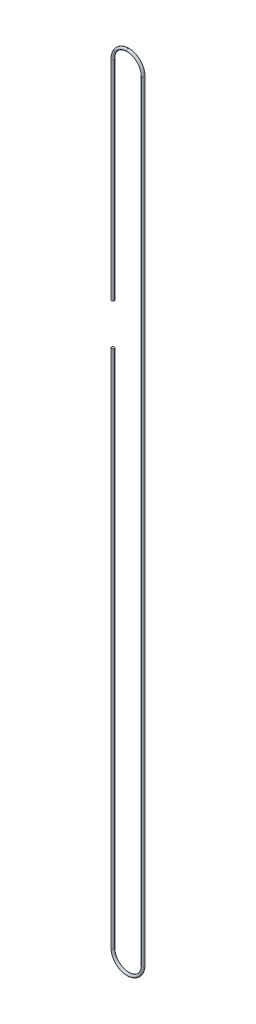
ISO-10303-21;
HEADER;
FILE_DESCRIPTION(('STEP AP214'),'2;1');
FILE_NAME('part.step','',(''),(''),'','','');
FILE_SCHEMA(('AUTOMOTIVE_DESIGN { 1 0 10303 214 1 1 1 1 }'));
ENDSEC;
DATA;
#1=APPLICATION_CONTEXT('core data for automotive mechanical design processes');
#2=APPLICATION_PROTOCOL_DEFINITION('international standard','automotive_design',2000,#1);
#3=PRODUCT_CONTEXT('',#1,'mechanical');
#4=PRODUCT('Part','Part','',(#3));
#5=PRODUCT_RELATED_PRODUCT_CATEGORY('part','',(#4));
#6=PRODUCT_DEFINITION_FORMATION('','',#4);
#7=PRODUCT_DEFINITION_CONTEXT('part definition',#1,'design');
#8=PRODUCT_DEFINITION('design','',#6,#7);
#9=PRODUCT_DEFINITION_SHAPE('','',#8);
#10=(LENGTH_UNIT() NAMED_UNIT(*) SI_UNIT(.MILLI.,.METRE.));
#11=(NAMED_UNIT(*) PLANE_ANGLE_UNIT() SI_UNIT($,.RADIAN.));
#12=(NAMED_UNIT(*) SI_UNIT($,.STERADIAN.) SOLID_ANGLE_UNIT());
#13=UNCERTAINTY_MEASURE_WITH_UNIT(LENGTH_MEASURE(1.E-05),#10,'distance_accuracy_value','');
#14=(GEOMETRIC_REPRESENTATION_CONTEXT(3) GLOBAL_UNCERTAINTY_ASSIGNED_CONTEXT((#13)) GLOBAL_UNIT_ASSIGNED_CONTEXT((#10,
#11,#12)) REPRESENTATION_CONTEXT('',''));
#15=CARTESIAN_POINT('',(0.,0.,0.));
#16=DIRECTION('',(0.,0.,1.));
#17=DIRECTION('',(1.,0.,0.));
#18=AXIS2_PLACEMENT_3D('',#15,#16,#17);
#19=CARTESIAN_POINT('',(-17.4625,0.,0.));
#20=DIRECTION('',(0.,1.,0.));
#21=DIRECTION('',(-1.,0.,0.));
#22=AXIS2_PLACEMENT_3D('',#19,#20,#21);
#23=CYLINDRICAL_SURFACE('',#22,1.58750000000002);
#24=CARTESIAN_POINT('',(-17.4625000000001,647.7,0.));
#25=DIRECTION('',(0.,1.,0.));
#26=DIRECTION('',(0.,0.,1.));
#27=AXIS2_PLACEMENT_3D('',#24,#25,#26);
#28=CIRCLE('',#27,1.58750000000002);
#29=CARTESIAN_POINT('',(-17.4625000000001,647.7,1.58750000000002));
#30=VERTEX_POINT('',#29);
#31=EDGE_CURVE('E10',#30,#30,#28,.F.);
#32=ORIENTED_EDGE('',*,*,#31,.F.);
#33=EDGE_LOOP('',(#32));
#34=FACE_BOUND('',#33,.T.);
#35=CARTESIAN_POINT('',(-17.4625000000002,889.,0.));
#36=DIRECTION('',(0.,1.,0.));
#37=DIRECTION('',(0.,0.,-1.));
#38=AXIS2_PLACEMENT_3D('',#35,#36,#37);
#39=CIRCLE('',#38,1.58750000000002);
#40=CARTESIAN_POINT('',(-19.0500000000002,889.,0.));
#41=VERTEX_POINT('',#40);
#42=EDGE_CURVE('E50',#41,#41,#39,.T.);
#43=ORIENTED_EDGE('',*,*,#42,.F.);
#44=EDGE_LOOP('',(#43));
#45=FACE_BOUND('',#44,.T.);
#46=ADVANCED_FACE('F36',(#34,#45),#23,.T.);
#47=CARTESIAN_POINT('',(0.,889.,0.));
#48=DIRECTION('',(0.,0.,-1.));
#49=DIRECTION('',(-1.,0.,0.));
#50=AXIS2_PLACEMENT_3D('',#47,#48,#49);
#51=TOROIDAL_SURFACE('',#50,17.4625000000002,1.58750000000002);
#52=CARTESIAN_POINT('',(0.,906.4625,0.));
#53=DIRECTION('',(1.,0.,0.));
#54=DIRECTION('',(0.,0.,-1.));
#55=AXIS2_PLACEMENT_3D('',#52,#53,#54);
#56=CIRCLE('',#55,1.58750000000002);
#57=CARTESIAN_POINT('',(0.,908.05,0.));
#58=VERTEX_POINT('',#57);
#59=EDGE_CURVE('E69',#58,#58,#56,.T.);
#60=CARTESIAN_POINT('',(0.,889.,0.));
#61=DIRECTION('',(0.,0.,-1.));
#62=DIRECTION('',(-1.,0.,0.));
#63=AXIS2_PLACEMENT_3D('',#60,#61,#62);
#64=CIRCLE('',#63,19.0500000000002);
#65=EDGE_CURVE('',#41,#58,#64,.T.);
#66=ORIENTED_EDGE('',*,*,#42,.T.);
#67=ORIENTED_EDGE('',*,*,#59,.F.);
#68=ORIENTED_EDGE('',*,*,#65,.T.);
#69=ORIENTED_EDGE('',*,*,#65,.F.);
#70=EDGE_LOOP('',(#66,#68,#67,#69));
#71=FACE_BOUND('',#70,.T.);
#72=ADVANCED_FACE('F38',(#71),#51,.T.);
#73=CARTESIAN_POINT('',(-17.4625000000001,600.075,0.));
#74=DIRECTION('',(0.,-1.,0.));
#75=DIRECTION('',(0.,0.,-1.));
#76=AXIS2_PLACEMENT_3D('',#73,#74,#75);
#77=CIRCLE('',#76,1.58750000000002);
#78=CARTESIAN_POINT('',(-17.4625000000001,600.075,-1.58750000000002));
#79=VERTEX_POINT('',#78);
#80=EDGE_CURVE('E44',#79,#79,#77,.F.);
#81=ORIENTED_EDGE('',*,*,#80,.F.);
#82=EDGE_LOOP('',(#81));
#83=FACE_BOUND('',#82,.T.);
#84=CARTESIAN_POINT('',(-17.4625,0.,0.));
#85=DIRECTION('',(0.,1.,0.));
#86=DIRECTION('',(0.,0.,-1.));
#87=AXIS2_PLACEMENT_3D('',#84,#85,#86);
#88=CIRCLE('',#87,1.58750000000002);
#89=CARTESIAN_POINT('',(-19.0500000000001,0.,0.));
#90=VERTEX_POINT('',#89);
#91=EDGE_CURVE('E57',#90,#90,#88,.T.);
#92=ORIENTED_EDGE('',*,*,#91,.T.);
#93=EDGE_LOOP('',(#92));
#94=FACE_BOUND('',#93,.T.);
#95=ADVANCED_FACE('F77',(#83,#94),#23,.T.);
#96=CARTESIAN_POINT('',(0.,0.,0.));
#97=DIRECTION('',(0.,0.,-1.));
#98=DIRECTION('',(-1.,0.,0.));
#99=AXIS2_PLACEMENT_3D('',#96,#97,#98);
#100=TOROIDAL_SURFACE('',#99,17.4625,1.58750000000002);
#101=CARTESIAN_POINT('',(17.4625,0.,0.));
#102=DIRECTION('',(0.,-1.,0.));
#103=DIRECTION('',(0.,0.,-1.));
#104=AXIS2_PLACEMENT_3D('',#101,#102,#103);
#105=CIRCLE('',#104,1.58750000000002);
#106=CARTESIAN_POINT('',(19.0500000000001,0.,0.));
#107=VERTEX_POINT('',#106);
#108=EDGE_CURVE('E62',#107,#107,#105,.T.);
#109=CARTESIAN_POINT('',(0.,0.,0.));
#110=DIRECTION('',(0.,0.,-1.));
#111=DIRECTION('',(-1.,0.,0.));
#112=AXIS2_PLACEMENT_3D('',#109,#110,#111);
#113=CIRCLE('',#112,19.0500000000001);
#114=EDGE_CURVE('',#107,#90,#113,.T.);
#115=ORIENTED_EDGE('',*,*,#108,.T.);
#116=ORIENTED_EDGE('',*,*,#91,.F.);
#117=ORIENTED_EDGE('',*,*,#114,.T.);
#118=ORIENTED_EDGE('',*,*,#114,.F.);
#119=EDGE_LOOP('',(#115,#117,#116,#118));
#120=FACE_BOUND('',#119,.T.);
#121=ADVANCED_FACE('F86',(#120),#100,.T.);
#122=CARTESIAN_POINT('',(17.4625000000002,889.,0.));
#123=DIRECTION('',(0.,-1.,0.));
#124=DIRECTION('',(1.,0.,0.));
#125=AXIS2_PLACEMENT_3D('',#122,#123,#124);
#126=CYLINDRICAL_SURFACE('',#125,1.58750000000002);
#127=ORIENTED_EDGE('',*,*,#108,.F.);
#128=EDGE_LOOP('',(#127));
#129=FACE_BOUND('',#128,.T.);
#130=CARTESIAN_POINT('',(17.4625000000002,889.,0.));
#131=DIRECTION('',(0.,-1.,0.));
#132=DIRECTION('',(0.,0.,-1.));
#133=AXIS2_PLACEMENT_3D('',#130,#131,#132);
#134=CIRCLE('',#133,1.58750000000002);
#135=CARTESIAN_POINT('',(19.0500000000002,889.,0.));
#136=VERTEX_POINT('',#135);
#137=EDGE_CURVE('E65',#136,#136,#134,.T.);
#138=ORIENTED_EDGE('',*,*,#137,.T.);
#139=EDGE_LOOP('',(#138));
#140=FACE_BOUND('',#139,.T.);
#141=ADVANCED_FACE('F91',(#129,#140),#126,.T.);
#142=CARTESIAN_POINT('',(0.,889.,0.));
#143=DIRECTION('',(0.,0.,-1.));
#144=DIRECTION('',(-1.,0.,0.));
#145=AXIS2_PLACEMENT_3D('',#142,#143,#144);
#146=TOROIDAL_SURFACE('',#145,17.4625000000002,1.58750000000002);
#147=CARTESIAN_POINT('',(0.,889.,0.));
#148=DIRECTION('',(0.,0.,-1.));
#149=DIRECTION('',(-1.,0.,0.));
#150=AXIS2_PLACEMENT_3D('',#147,#148,#149);
#151=CIRCLE('',#150,19.0500000000002);
#152=EDGE_CURVE('',#58,#136,#151,.T.);
#153=ORIENTED_EDGE('',*,*,#59,.T.);
#154=ORIENTED_EDGE('',*,*,#137,.F.);
#155=ORIENTED_EDGE('',*,*,#152,.T.);
#156=ORIENTED_EDGE('',*,*,#152,.F.);
#157=EDGE_LOOP('',(#153,#155,#154,#156));
#158=FACE_BOUND('',#157,.T.);
#159=ADVANCED_FACE('F73',(#158),#146,.T.);
#160=CARTESIAN_POINT('',(-38.2584864849503,600.075,-1.58750000000002));
#161=DIRECTION('',(0.,-1.,0.));
#162=DIRECTION('',(0.,0.,-1.));
#163=AXIS2_PLACEMENT_3D('',#160,#161,#162);
#164=PLANE('',#163);
#165=ORIENTED_EDGE('',*,*,#80,.T.);
#166=EDGE_LOOP('',(#165));
#167=FACE_BOUND('',#166,.T.);
#168=ADVANCED_FACE('F104',(#167),#164,.F.);
#169=CARTESIAN_POINT('',(-38.2584864849504,647.7,-1.58750000000002));
#170=DIRECTION('',(0.,1.,0.));
#171=DIRECTION('',(0.,0.,1.));
#172=AXIS2_PLACEMENT_3D('',#169,#170,#171);
#173=PLANE('',#172);
#174=ORIENTED_EDGE('',*,*,#31,.T.);
#175=EDGE_LOOP('',(#174));
#176=FACE_BOUND('',#175,.T.);
#177=ADVANCED_FACE('F109',(#176),#173,.F.);
#178=CLOSED_SHELL('',(#46,#72,#95,#121,#141,#159,#168,#177));
#179=MANIFOLD_SOLID_BREP('B2',#178);
#180=ADVANCED_BREP_SHAPE_REPRESENTATION('',(#18,#179),#14);
#181=SHAPE_DEFINITION_REPRESENTATION(#9,#180);
ENDSEC;
END-ISO-10303-21;
